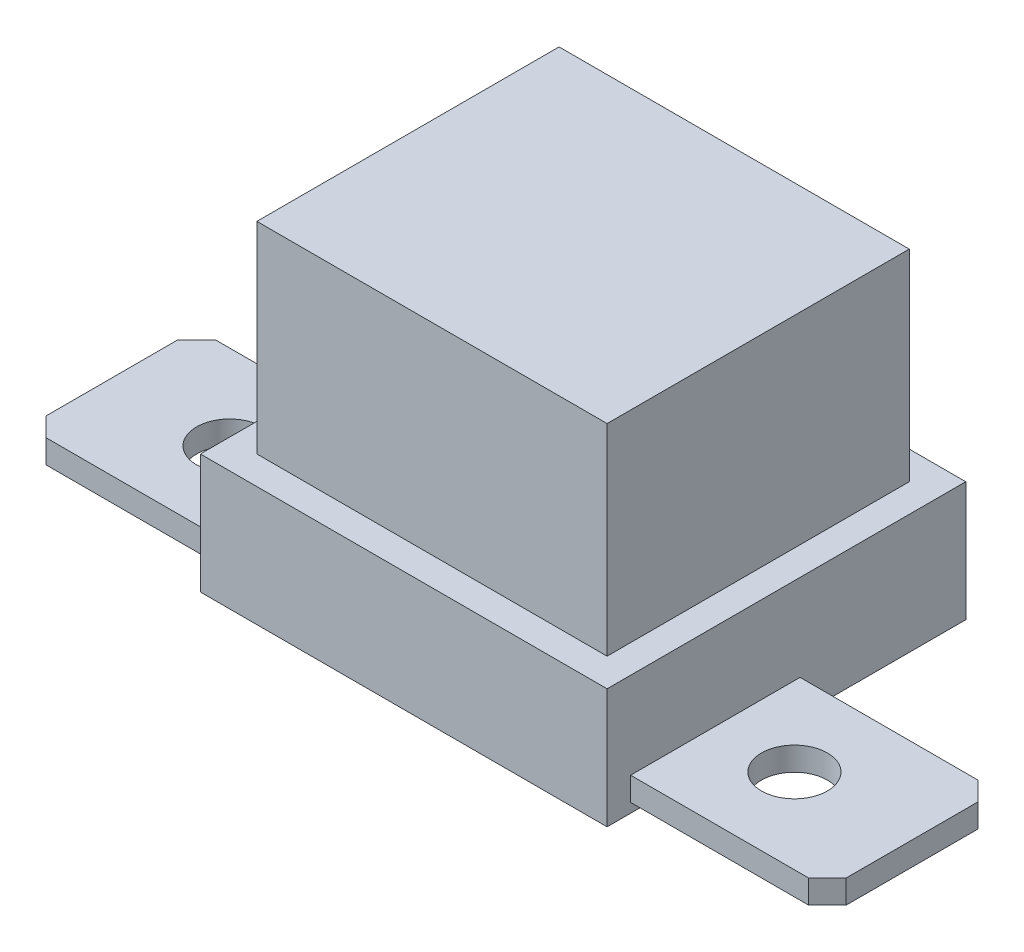
ISO-10303-21;
HEADER;
FILE_DESCRIPTION(('STEP AP214'),'2;1');
FILE_NAME('part.step','',(''),(''),'','','');
FILE_SCHEMA(('AUTOMOTIVE_DESIGN { 1 0 10303 214 1 1 1 1 }'));
ENDSEC;
DATA;
#1=APPLICATION_CONTEXT('core data for automotive mechanical design processes');
#2=APPLICATION_PROTOCOL_DEFINITION('international standard','automotive_design',2000,#1);
#3=PRODUCT_CONTEXT('',#1,'mechanical');
#4=PRODUCT('Part','Part','',(#3));
#5=PRODUCT_RELATED_PRODUCT_CATEGORY('part','',(#4));
#6=PRODUCT_DEFINITION_FORMATION('','',#4);
#7=PRODUCT_DEFINITION_CONTEXT('part definition',#1,'design');
#8=PRODUCT_DEFINITION('design','',#6,#7);
#9=PRODUCT_DEFINITION_SHAPE('','',#8);
#10=(LENGTH_UNIT() NAMED_UNIT(*) SI_UNIT(.MILLI.,.METRE.));
#11=(NAMED_UNIT(*) PLANE_ANGLE_UNIT() SI_UNIT($,.RADIAN.));
#12=(NAMED_UNIT(*) SI_UNIT($,.STERADIAN.) SOLID_ANGLE_UNIT());
#13=UNCERTAINTY_MEASURE_WITH_UNIT(LENGTH_MEASURE(1.E-05),#10,'distance_accuracy_value','');
#14=(GEOMETRIC_REPRESENTATION_CONTEXT(3) GLOBAL_UNCERTAINTY_ASSIGNED_CONTEXT((#13)) GLOBAL_UNIT_ASSIGNED_CONTEXT((#10,
#11,#12)) REPRESENTATION_CONTEXT('',''));
#15=CARTESIAN_POINT('',(0.,0.,0.));
#16=DIRECTION('',(0.,0.,1.));
#17=DIRECTION('',(1.,0.,0.));
#18=AXIS2_PLACEMENT_3D('',#15,#16,#17);
#19=CARTESIAN_POINT('',(21.6,12.7,19.05));
#20=DIRECTION('',(-1.,0.,0.));
#21=DIRECTION('',(0.,0.,1.));
#22=AXIS2_PLACEMENT_3D('',#19,#20,#21);
#23=PLANE('',#22);
#24=DIRECTION('',(0.,0.,-1.));
#25=VECTOR('',#24,1.);
#26=CARTESIAN_POINT('',(21.6,0.,19.05));
#27=LINE('',#26,#25);
#28=CARTESIAN_POINT('',(21.6,0.,19.05));
#29=VERTEX_POINT('',#28);
#30=CARTESIAN_POINT('',(21.6,0.,-19.05));
#31=VERTEX_POINT('',#30);
#32=EDGE_CURVE('E290',#29,#31,#27,.T.);
#33=ORIENTED_EDGE('',*,*,#32,.T.);
#34=DIRECTION('',(0.,-1.,0.));
#35=VECTOR('',#34,1.);
#36=CARTESIAN_POINT('',(21.6,12.7,-19.05));
#37=LINE('',#36,#35);
#38=CARTESIAN_POINT('',(21.6,12.7,-19.05));
#39=VERTEX_POINT('',#38);
#40=EDGE_CURVE('E317',#39,#31,#37,.T.);
#41=ORIENTED_EDGE('',*,*,#40,.F.);
#42=DIRECTION('',(0.,0.,-1.));
#43=VECTOR('',#42,1.);
#44=CARTESIAN_POINT('',(21.6,12.7,19.05));
#45=LINE('',#44,#43);
#46=CARTESIAN_POINT('',(21.6,12.7,19.05));
#47=VERTEX_POINT('',#46);
#48=EDGE_CURVE('E291',#47,#39,#45,.T.);
#49=ORIENTED_EDGE('',*,*,#48,.F.);
#50=DIRECTION('',(0.,-1.,0.));
#51=VECTOR('',#50,1.);
#52=CARTESIAN_POINT('',(21.6,12.7,19.05));
#53=LINE('',#52,#51);
#54=EDGE_CURVE('E301',#47,#29,#53,.T.);
#55=ORIENTED_EDGE('',*,*,#54,.T.);
#56=EDGE_LOOP('',(#33,#41,#49,#55));
#57=FACE_BOUND('',#56,.T.);
#58=DIRECTION('',(0.,-1.,0.));
#59=VECTOR('',#58,1.);
#60=CARTESIAN_POINT('',(21.6,3.5,16.55));
#61=LINE('',#60,#59);
#62=CARTESIAN_POINT('',(21.6,3.5,16.55));
#63=VERTEX_POINT('',#62);
#64=CARTESIAN_POINT('',(21.6,1.,16.55));
#65=VERTEX_POINT('',#64);
#66=EDGE_CURVE('E55',#63,#65,#61,.T.);
#67=ORIENTED_EDGE('',*,*,#66,.F.);
#68=DIRECTION('',(0.,0.,1.));
#69=VECTOR('',#68,1.);
#70=CARTESIAN_POINT('',(21.6,3.5,-1.45));
#71=LINE('',#70,#69);
#72=CARTESIAN_POINT('',(21.6,3.5,-1.45));
#73=VERTEX_POINT('',#72);
#74=EDGE_CURVE('E201',#73,#63,#71,.T.);
#75=ORIENTED_EDGE('',*,*,#74,.F.);
#76=DIRECTION('',(0.,-1.,0.));
#77=VECTOR('',#76,1.);
#78=CARTESIAN_POINT('',(21.6,3.5,-1.45));
#79=LINE('',#78,#77);
#80=CARTESIAN_POINT('',(21.6,0.999999999999999,-1.45));
#81=VERTEX_POINT('',#80);
#82=EDGE_CURVE('E197',#73,#81,#79,.T.);
#83=ORIENTED_EDGE('',*,*,#82,.T.);
#84=DIRECTION('',(0.,0.,1.));
#85=VECTOR('',#84,1.);
#86=CARTESIAN_POINT('',(21.6,1.,-1.45));
#87=LINE('',#86,#85);
#88=EDGE_CURVE('E60',#81,#65,#87,.T.);
#89=ORIENTED_EDGE('',*,*,#88,.T.);
#90=EDGE_LOOP('',(#67,#75,#83,#89));
#91=FACE_BOUND('',#90,.T.);
#92=ADVANCED_FACE('F40',(#57,#91),#23,.F.);
#93=CARTESIAN_POINT('',(-21.6,12.7,19.05));
#94=DIRECTION('',(1.,0.,0.));
#95=DIRECTION('',(0.,0.,-1.));
#96=AXIS2_PLACEMENT_3D('',#93,#94,#95);
#97=PLANE('',#96);
#98=DIRECTION('',(0.,0.,1.));
#99=VECTOR('',#98,1.);
#100=CARTESIAN_POINT('',(-21.6,0.,19.05));
#101=LINE('',#100,#99);
#102=CARTESIAN_POINT('',(-21.6,0.,-19.05));
#103=VERTEX_POINT('',#102);
#104=CARTESIAN_POINT('',(-21.6,0.,19.05));
#105=VERTEX_POINT('',#104);
#106=EDGE_CURVE('E306',#103,#105,#101,.T.);
#107=ORIENTED_EDGE('',*,*,#106,.T.);
#108=DIRECTION('',(0.,-1.,0.));
#109=VECTOR('',#108,1.);
#110=CARTESIAN_POINT('',(-21.6,12.7,19.05));
#111=LINE('',#110,#109);
#112=CARTESIAN_POINT('',(-21.6,12.7,19.05));
#113=VERTEX_POINT('',#112);
#114=EDGE_CURVE('E311',#113,#105,#111,.T.);
#115=ORIENTED_EDGE('',*,*,#114,.F.);
#116=DIRECTION('',(0.,0.,1.));
#117=VECTOR('',#116,1.);
#118=CARTESIAN_POINT('',(-21.6,12.7,19.05));
#119=LINE('',#118,#117);
#120=CARTESIAN_POINT('',(-21.6,12.7,-19.05));
#121=VERTEX_POINT('',#120);
#122=EDGE_CURVE('E297',#121,#113,#119,.T.);
#123=ORIENTED_EDGE('',*,*,#122,.F.);
#124=DIRECTION('',(0.,-1.,0.));
#125=VECTOR('',#124,1.);
#126=CARTESIAN_POINT('',(-21.6,12.7,-19.05));
#127=LINE('',#126,#125);
#128=EDGE_CURVE('E314',#121,#103,#127,.T.);
#129=ORIENTED_EDGE('',*,*,#128,.T.);
#130=EDGE_LOOP('',(#107,#115,#123,#129));
#131=FACE_BOUND('',#130,.T.);
#132=DIRECTION('',(0.,-1.,0.));
#133=VECTOR('',#132,1.);
#134=CARTESIAN_POINT('',(-21.6,3.5,-1.45));
#135=LINE('',#134,#133);
#136=CARTESIAN_POINT('',(-21.6,3.5,-1.45));
#137=VERTEX_POINT('',#136);
#138=CARTESIAN_POINT('',(-21.6,1.,-1.45));
#139=VERTEX_POINT('',#138);
#140=EDGE_CURVE('E275',#137,#139,#135,.T.);
#141=ORIENTED_EDGE('',*,*,#140,.F.);
#142=DIRECTION('',(0.,0.,-1.));
#143=VECTOR('',#142,1.);
#144=CARTESIAN_POINT('',(-21.6,3.5,-1.45));
#145=LINE('',#144,#143);
#146=CARTESIAN_POINT('',(-21.6,3.5,16.55));
#147=VERTEX_POINT('',#146);
#148=EDGE_CURVE('E235',#147,#137,#145,.T.);
#149=ORIENTED_EDGE('',*,*,#148,.F.);
#150=DIRECTION('',(0.,-1.,0.));
#151=VECTOR('',#150,1.);
#152=CARTESIAN_POINT('',(-21.6,3.5,16.55));
#153=LINE('',#152,#151);
#154=CARTESIAN_POINT('',(-21.6,0.999999999999999,16.55));
#155=VERTEX_POINT('',#154);
#156=EDGE_CURVE('E250',#147,#155,#153,.T.);
#157=ORIENTED_EDGE('',*,*,#156,.T.);
#158=DIRECTION('',(0.,0.,-1.));
#159=VECTOR('',#158,1.);
#160=CARTESIAN_POINT('',(-21.6,1.,-1.45));
#161=LINE('',#160,#159);
#162=EDGE_CURVE('E232',#155,#139,#161,.T.);
#163=ORIENTED_EDGE('',*,*,#162,.T.);
#164=EDGE_LOOP('',(#141,#149,#157,#163));
#165=FACE_BOUND('',#164,.T.);
#166=ADVANCED_FACE('F366',(#131,#165),#97,.F.);
#167=CARTESIAN_POINT('',(-18.6,34.1,0.));
#168=DIRECTION('',(-1.,0.,0.));
#169=DIRECTION('',(0.,0.,1.));
#170=AXIS2_PLACEMENT_3D('',#167,#168,#169);
#171=PLANE('',#170);
#172=DIRECTION('',(0.,-1.,0.));
#173=VECTOR('',#172,1.);
#174=CARTESIAN_POINT('',(-18.6,34.1,-16.05));
#175=LINE('',#174,#173);
#176=CARTESIAN_POINT('',(-18.6,34.1,-16.05));
#177=VERTEX_POINT('',#176);
#178=CARTESIAN_POINT('',(-18.6,12.7,-16.05));
#179=VERTEX_POINT('',#178);
#180=EDGE_CURVE('E330',#177,#179,#175,.T.);
#181=ORIENTED_EDGE('',*,*,#180,.T.);
#182=DIRECTION('',(0.,0.,1.));
#183=VECTOR('',#182,1.);
#184=CARTESIAN_POINT('',(-18.6,12.7,16.05));
#185=LINE('',#184,#183);
#186=CARTESIAN_POINT('',(-18.6,12.7,16.05));
#187=VERTEX_POINT('',#186);
#188=EDGE_CURVE('E287',#179,#187,#185,.T.);
#189=ORIENTED_EDGE('',*,*,#188,.T.);
#190=DIRECTION('',(0.,-1.,0.));
#191=VECTOR('',#190,1.);
#192=CARTESIAN_POINT('',(-18.6,34.1,16.05));
#193=LINE('',#192,#191);
#194=CARTESIAN_POINT('',(-18.6,34.1,16.05));
#195=VERTEX_POINT('',#194);
#196=EDGE_CURVE('E11',#195,#187,#193,.T.);
#197=ORIENTED_EDGE('',*,*,#196,.F.);
#198=DIRECTION('',(0.,0.,-1.));
#199=VECTOR('',#198,1.);
#200=CARTESIAN_POINT('',(-18.6,34.1,0.));
#201=LINE('',#200,#199);
#202=EDGE_CURVE('E320',#195,#177,#201,.T.);
#203=ORIENTED_EDGE('',*,*,#202,.T.);
#204=EDGE_LOOP('',(#181,#189,#197,#203));
#205=FACE_BOUND('',#204,.T.);
#206=ADVANCED_FACE('F42',(#205),#171,.T.);
#207=CARTESIAN_POINT('',(0.,34.1,16.05));
#208=DIRECTION('',(0.,0.,-1.));
#209=DIRECTION('',(-1.,0.,0.));
#210=AXIS2_PLACEMENT_3D('',#207,#208,#209);
#211=PLANE('',#210);
#212=DIRECTION('',(1.,0.,0.));
#213=VECTOR('',#212,1.);
#214=CARTESIAN_POINT('',(-18.6,12.7,16.05));
#215=LINE('',#214,#213);
#216=CARTESIAN_POINT('',(18.6,12.7,16.05));
#217=VERTEX_POINT('',#216);
#218=EDGE_CURVE('E278',#187,#217,#215,.T.);
#219=ORIENTED_EDGE('',*,*,#218,.T.);
#220=DIRECTION('',(0.,-1.,0.));
#221=VECTOR('',#220,1.);
#222=CARTESIAN_POINT('',(18.6,34.1,16.05));
#223=LINE('',#222,#221);
#224=CARTESIAN_POINT('',(18.6,34.1,16.05));
#225=VERTEX_POINT('',#224);
#226=EDGE_CURVE('E48',#225,#217,#223,.T.);
#227=ORIENTED_EDGE('',*,*,#226,.F.);
#228=DIRECTION('',(1.,0.,0.));
#229=VECTOR('',#228,1.);
#230=CARTESIAN_POINT('',(0.,34.1,16.05));
#231=LINE('',#230,#229);
#232=EDGE_CURVE('E323',#195,#225,#231,.T.);
#233=ORIENTED_EDGE('',*,*,#232,.F.);
#234=ORIENTED_EDGE('',*,*,#196,.T.);
#235=EDGE_LOOP('',(#219,#227,#233,#234));
#236=FACE_BOUND('',#235,.T.);
#237=ADVANCED_FACE('F343',(#236),#211,.F.);
#238=CARTESIAN_POINT('',(18.6,34.1,0.));
#239=DIRECTION('',(-1.,0.,0.));
#240=DIRECTION('',(0.,0.,1.));
#241=AXIS2_PLACEMENT_3D('',#238,#239,#240);
#242=PLANE('',#241);
#243=DIRECTION('',(0.,0.,-1.));
#244=VECTOR('',#243,1.);
#245=CARTESIAN_POINT('',(18.6,12.7,16.05));
#246=LINE('',#245,#244);
#247=CARTESIAN_POINT('',(18.6,12.7,-16.05));
#248=VERTEX_POINT('',#247);
#249=EDGE_CURVE('E281',#217,#248,#246,.T.);
#250=ORIENTED_EDGE('',*,*,#249,.T.);
#251=DIRECTION('',(0.,-1.,0.));
#252=VECTOR('',#251,1.);
#253=CARTESIAN_POINT('',(18.6,34.1,-16.05));
#254=LINE('',#253,#252);
#255=CARTESIAN_POINT('',(18.6,34.1,-16.05));
#256=VERTEX_POINT('',#255);
#257=EDGE_CURVE('E333',#256,#248,#254,.T.);
#258=ORIENTED_EDGE('',*,*,#257,.F.);
#259=DIRECTION('',(0.,0.,-1.));
#260=VECTOR('',#259,1.);
#261=CARTESIAN_POINT('',(18.6,34.1,0.));
#262=LINE('',#261,#260);
#263=EDGE_CURVE('E325',#225,#256,#262,.T.);
#264=ORIENTED_EDGE('',*,*,#263,.F.);
#265=ORIENTED_EDGE('',*,*,#226,.T.);
#266=EDGE_LOOP('',(#250,#258,#264,#265));
#267=FACE_BOUND('',#266,.T.);
#268=ADVANCED_FACE('F339',(#267),#242,.F.);
#269=CARTESIAN_POINT('',(0.,34.1,-16.05));
#270=DIRECTION('',(0.,0.,-1.));
#271=DIRECTION('',(-1.,0.,0.));
#272=AXIS2_PLACEMENT_3D('',#269,#270,#271);
#273=PLANE('',#272);
#274=ORIENTED_EDGE('',*,*,#257,.T.);
#275=DIRECTION('',(-1.,0.,0.));
#276=VECTOR('',#275,1.);
#277=CARTESIAN_POINT('',(-18.6,12.7,-16.05));
#278=LINE('',#277,#276);
#279=EDGE_CURVE('E284',#248,#179,#278,.T.);
#280=ORIENTED_EDGE('',*,*,#279,.T.);
#281=ORIENTED_EDGE('',*,*,#180,.F.);
#282=DIRECTION('',(1.,0.,0.));
#283=VECTOR('',#282,1.);
#284=CARTESIAN_POINT('',(0.,34.1,-16.05));
#285=LINE('',#284,#283);
#286=EDGE_CURVE('E327',#177,#256,#285,.T.);
#287=ORIENTED_EDGE('',*,*,#286,.T.);
#288=EDGE_LOOP('',(#274,#280,#281,#287));
#289=FACE_BOUND('',#288,.T.);
#290=ADVANCED_FACE('F350',(#289),#273,.T.);
#291=CARTESIAN_POINT('',(0.,34.1,0.));
#292=DIRECTION('',(0.,1.,0.));
#293=DIRECTION('',(0.,0.,1.));
#294=AXIS2_PLACEMENT_3D('',#291,#292,#293);
#295=PLANE('',#294);
#296=ORIENTED_EDGE('',*,*,#202,.F.);
#297=ORIENTED_EDGE('',*,*,#232,.T.);
#298=ORIENTED_EDGE('',*,*,#263,.T.);
#299=ORIENTED_EDGE('',*,*,#286,.F.);
#300=EDGE_LOOP('',(#296,#297,#298,#299));
#301=FACE_BOUND('',#300,.T.);
#302=ADVANCED_FACE('F352',(#301),#295,.T.);
#303=CARTESIAN_POINT('',(0.,12.7,0.));
#304=DIRECTION('',(0.,-1.,0.));
#305=DIRECTION('',(0.,0.,-1.));
#306=AXIS2_PLACEMENT_3D('',#303,#304,#305);
#307=PLANE('',#306);
#308=ORIENTED_EDGE('',*,*,#48,.T.);
#309=DIRECTION('',(-1.,0.,0.));
#310=VECTOR('',#309,1.);
#311=CARTESIAN_POINT('',(-21.6,12.7,-19.05));
#312=LINE('',#311,#310);
#313=EDGE_CURVE('E294',#39,#121,#312,.T.);
#314=ORIENTED_EDGE('',*,*,#313,.T.);
#315=ORIENTED_EDGE('',*,*,#122,.T.);
#316=DIRECTION('',(1.,0.,0.));
#317=VECTOR('',#316,1.);
#318=CARTESIAN_POINT('',(-21.6,12.7,19.05));
#319=LINE('',#318,#317);
#320=EDGE_CURVE('E299',#113,#47,#319,.T.);
#321=ORIENTED_EDGE('',*,*,#320,.T.);
#322=EDGE_LOOP('',(#308,#314,#315,#321));
#323=FACE_BOUND('',#322,.T.);
#324=ORIENTED_EDGE('',*,*,#218,.F.);
#325=ORIENTED_EDGE('',*,*,#188,.F.);
#326=ORIENTED_EDGE('',*,*,#279,.F.);
#327=ORIENTED_EDGE('',*,*,#249,.F.);
#328=EDGE_LOOP('',(#324,#325,#326,#327));
#329=FACE_BOUND('',#328,.T.);
#330=ADVANCED_FACE('F346',(#323,#329),#307,.F.);
#331=CARTESIAN_POINT('',(-21.6,12.7,-19.05));
#332=DIRECTION('',(0.,0.,1.));
#333=DIRECTION('',(1.,0.,0.));
#334=AXIS2_PLACEMENT_3D('',#331,#332,#333);
#335=PLANE('',#334);
#336=DIRECTION('',(-1.,0.,0.));
#337=VECTOR('',#336,1.);
#338=CARTESIAN_POINT('',(-21.6,0.,-19.05));
#339=LINE('',#338,#337);
#340=EDGE_CURVE('E304',#31,#103,#339,.T.);
#341=ORIENTED_EDGE('',*,*,#340,.T.);
#342=ORIENTED_EDGE('',*,*,#128,.F.);
#343=ORIENTED_EDGE('',*,*,#313,.F.);
#344=ORIENTED_EDGE('',*,*,#40,.T.);
#345=EDGE_LOOP('',(#341,#342,#343,#344));
#346=FACE_BOUND('',#345,.T.);
#347=ADVANCED_FACE('F359',(#346),#335,.F.);
#348=CARTESIAN_POINT('',(-21.6,12.7,19.05));
#349=DIRECTION('',(0.,0.,-1.));
#350=DIRECTION('',(-1.,0.,0.));
#351=AXIS2_PLACEMENT_3D('',#348,#349,#350);
#352=PLANE('',#351);
#353=DIRECTION('',(1.,0.,0.));
#354=VECTOR('',#353,1.);
#355=CARTESIAN_POINT('',(-21.6,0.,19.05));
#356=LINE('',#355,#354);
#357=EDGE_CURVE('E295',#105,#29,#356,.T.);
#358=ORIENTED_EDGE('',*,*,#357,.T.);
#359=ORIENTED_EDGE('',*,*,#54,.F.);
#360=ORIENTED_EDGE('',*,*,#320,.F.);
#361=ORIENTED_EDGE('',*,*,#114,.T.);
#362=EDGE_LOOP('',(#358,#359,#360,#361));
#363=FACE_BOUND('',#362,.T.);
#364=ADVANCED_FACE('F375',(#363),#352,.F.);
#365=CARTESIAN_POINT('',(0.,0.,0.));
#366=DIRECTION('',(0.,1.,0.));
#367=DIRECTION('',(0.,0.,1.));
#368=AXIS2_PLACEMENT_3D('',#365,#366,#367);
#369=PLANE('',#368);
#370=ORIENTED_EDGE('',*,*,#32,.F.);
#371=ORIENTED_EDGE('',*,*,#357,.F.);
#372=ORIENTED_EDGE('',*,*,#106,.F.);
#373=ORIENTED_EDGE('',*,*,#340,.F.);
#374=EDGE_LOOP('',(#370,#371,#372,#373));
#375=FACE_BOUND('',#374,.T.);
#376=ADVANCED_FACE('F379',(#375),#369,.F.);
#377=CARTESIAN_POINT('',(0.,3.5,0.));
#378=DIRECTION('',(0.,-1.,0.));
#379=DIRECTION('',(0.,0.,-1.));
#380=AXIS2_PLACEMENT_3D('',#377,#378,#379);
#381=PLANE('',#380);
#382=ORIENTED_EDGE('',*,*,#148,.T.);
#383=DIRECTION('',(-1.,0.,0.));
#384=VECTOR('',#383,1.);
#385=CARTESIAN_POINT('',(-21.6,3.5,-1.45));
#386=LINE('',#385,#384);
#387=CARTESIAN_POINT('',(-40.5,3.5,-1.45));
#388=VERTEX_POINT('',#387);
#389=EDGE_CURVE('E238',#137,#388,#386,.T.);
#390=ORIENTED_EDGE('',*,*,#389,.T.);
#391=DIRECTION('',(-0.707106781186548,0.,0.707106781186547));
#392=VECTOR('',#391,1.);
#393=CARTESIAN_POINT('',(-40.5,3.5,-1.45));
#394=LINE('',#393,#392);
#395=CARTESIAN_POINT('',(-42.5,3.5,0.550000000000003));
#396=VERTEX_POINT('',#395);
#397=EDGE_CURVE('E241',#388,#396,#394,.T.);
#398=ORIENTED_EDGE('',*,*,#397,.T.);
#399=DIRECTION('',(0.,0.,1.));
#400=VECTOR('',#399,1.);
#401=CARTESIAN_POINT('',(-42.5,3.5,0.550000000000003));
#402=LINE('',#401,#400);
#403=CARTESIAN_POINT('',(-42.5,3.5,14.55));
#404=VERTEX_POINT('',#403);
#405=EDGE_CURVE('E243',#396,#404,#402,.T.);
#406=ORIENTED_EDGE('',*,*,#405,.T.);
#407=DIRECTION('',(0.707106781186548,0.,0.707106781186547));
#408=VECTOR('',#407,1.);
#409=CARTESIAN_POINT('',(-40.5,3.5,16.55));
#410=LINE('',#409,#408);
#411=CARTESIAN_POINT('',(-40.5,3.5,16.55));
#412=VERTEX_POINT('',#411);
#413=EDGE_CURVE('E245',#404,#412,#410,.T.);
#414=ORIENTED_EDGE('',*,*,#413,.T.);
#415=DIRECTION('',(1.,0.,0.));
#416=VECTOR('',#415,1.);
#417=CARTESIAN_POINT('',(-21.6,3.5,16.55));
#418=LINE('',#417,#416);
#419=EDGE_CURVE('E247',#412,#147,#418,.T.);
#420=ORIENTED_EDGE('',*,*,#419,.T.);
#421=EDGE_LOOP('',(#382,#390,#398,#406,#414,#420));
#422=FACE_BOUND('',#421,.T.);
#423=CARTESIAN_POINT('',(-30.,3.5,7.55));
#424=DIRECTION('',(0.,1.,0.));
#425=DIRECTION('',(0.,0.,1.));
#426=AXIS2_PLACEMENT_3D('',#423,#424,#425);
#427=CIRCLE('',#426,3.5);
#428=CARTESIAN_POINT('',(-30.,3.5,11.05));
#429=VERTEX_POINT('',#428);
#430=EDGE_CURVE('E229',#429,#429,#427,.T.);
#431=ORIENTED_EDGE('',*,*,#430,.F.);
#432=EDGE_LOOP('',(#431));
#433=FACE_BOUND('',#432,.T.);
#434=ADVANCED_FACE('F406',(#422,#433),#381,.F.);
#435=CARTESIAN_POINT('',(0.,1.,0.));
#436=DIRECTION('',(0.,-1.,0.));
#437=DIRECTION('',(0.,0.,-1.));
#438=AXIS2_PLACEMENT_3D('',#435,#436,#437);
#439=PLANE('',#438);
#440=ORIENTED_EDGE('',*,*,#162,.F.);
#441=DIRECTION('',(1.,0.,0.));
#442=VECTOR('',#441,1.);
#443=CARTESIAN_POINT('',(-21.6,1.,16.55));
#444=LINE('',#443,#442);
#445=CARTESIAN_POINT('',(-40.5,1.,16.55));
#446=VERTEX_POINT('',#445);
#447=EDGE_CURVE('E239',#446,#155,#444,.T.);
#448=ORIENTED_EDGE('',*,*,#447,.F.);
#449=DIRECTION('',(0.707106781186548,0.,0.707106781186547));
#450=VECTOR('',#449,1.);
#451=CARTESIAN_POINT('',(-40.5,1.,16.55));
#452=LINE('',#451,#450);
#453=CARTESIAN_POINT('',(-42.5,1.,14.55));
#454=VERTEX_POINT('',#453);
#455=EDGE_CURVE('E258',#454,#446,#452,.T.);
#456=ORIENTED_EDGE('',*,*,#455,.F.);
#457=DIRECTION('',(0.,0.,1.));
#458=VECTOR('',#457,1.);
#459=CARTESIAN_POINT('',(-42.5,1.,0.550000000000003));
#460=LINE('',#459,#458);
#461=CARTESIAN_POINT('',(-42.5,1.,0.550000000000003));
#462=VERTEX_POINT('',#461);
#463=EDGE_CURVE('E256',#462,#454,#460,.T.);
#464=ORIENTED_EDGE('',*,*,#463,.F.);
#465=DIRECTION('',(-0.707106781186548,0.,0.707106781186547));
#466=VECTOR('',#465,1.);
#467=CARTESIAN_POINT('',(-40.5,1.,-1.45));
#468=LINE('',#467,#466);
#469=CARTESIAN_POINT('',(-40.5,1.,-1.45));
#470=VERTEX_POINT('',#469);
#471=EDGE_CURVE('E254',#470,#462,#468,.T.);
#472=ORIENTED_EDGE('',*,*,#471,.F.);
#473=DIRECTION('',(-1.,0.,0.));
#474=VECTOR('',#473,1.);
#475=CARTESIAN_POINT('',(-21.6,1.,-1.45));
#476=LINE('',#475,#474);
#477=EDGE_CURVE('E252',#139,#470,#476,.T.);
#478=ORIENTED_EDGE('',*,*,#477,.F.);
#479=EDGE_LOOP('',(#440,#448,#456,#464,#472,#478));
#480=FACE_BOUND('',#479,.T.);
#481=CARTESIAN_POINT('',(-30.,1.,7.55));
#482=DIRECTION('',(0.,1.,0.));
#483=DIRECTION('',(0.,0.,1.));
#484=AXIS2_PLACEMENT_3D('',#481,#482,#483);
#485=CIRCLE('',#484,3.5);
#486=CARTESIAN_POINT('',(-30.,1.,11.05));
#487=VERTEX_POINT('',#486);
#488=EDGE_CURVE('E226',#487,#487,#485,.T.);
#489=ORIENTED_EDGE('',*,*,#488,.T.);
#490=EDGE_LOOP('',(#489));
#491=FACE_BOUND('',#490,.T.);
#492=ADVANCED_FACE('F386',(#480,#491),#439,.T.);
#493=CARTESIAN_POINT('',(-21.6,3.5,-1.45));
#494=DIRECTION('',(0.,0.,1.));
#495=DIRECTION('',(1.,0.,0.));
#496=AXIS2_PLACEMENT_3D('',#493,#494,#495);
#497=PLANE('',#496);
#498=ORIENTED_EDGE('',*,*,#477,.T.);
#499=DIRECTION('',(0.,-1.,0.));
#500=VECTOR('',#499,1.);
#501=CARTESIAN_POINT('',(-40.5,3.5,-1.45));
#502=LINE('',#501,#500);
#503=EDGE_CURVE('E272',#388,#470,#502,.T.);
#504=ORIENTED_EDGE('',*,*,#503,.F.);
#505=ORIENTED_EDGE('',*,*,#389,.F.);
#506=ORIENTED_EDGE('',*,*,#140,.T.);
#507=EDGE_LOOP('',(#498,#504,#505,#506));
#508=FACE_BOUND('',#507,.T.);
#509=ADVANCED_FACE('F382',(#508),#497,.F.);
#510=CARTESIAN_POINT('',(-40.5,3.5,-1.45));
#511=DIRECTION('',(0.707106781186547,0.,0.707106781186548));
#512=DIRECTION('',(0.707106781186548,0.,-0.707106781186547));
#513=AXIS2_PLACEMENT_3D('',#510,#511,#512);
#514=PLANE('',#513);
#515=ORIENTED_EDGE('',*,*,#471,.T.);
#516=DIRECTION('',(0.,-1.,0.));
#517=VECTOR('',#516,1.);
#518=CARTESIAN_POINT('',(-42.5,3.5,0.550000000000003));
#519=LINE('',#518,#517);
#520=EDGE_CURVE('E269',#396,#462,#519,.T.);
#521=ORIENTED_EDGE('',*,*,#520,.F.);
#522=ORIENTED_EDGE('',*,*,#397,.F.);
#523=ORIENTED_EDGE('',*,*,#503,.T.);
#524=EDGE_LOOP('',(#515,#521,#522,#523));
#525=FACE_BOUND('',#524,.T.);
#526=ADVANCED_FACE('F385',(#525),#514,.F.);
#527=CARTESIAN_POINT('',(-42.5,3.5,0.550000000000003));
#528=DIRECTION('',(1.,0.,0.));
#529=DIRECTION('',(0.,0.,-1.));
#530=AXIS2_PLACEMENT_3D('',#527,#528,#529);
#531=PLANE('',#530);
#532=ORIENTED_EDGE('',*,*,#463,.T.);
#533=DIRECTION('',(0.,-1.,0.));
#534=VECTOR('',#533,1.);
#535=CARTESIAN_POINT('',(-42.5,3.5,14.55));
#536=LINE('',#535,#534);
#537=EDGE_CURVE('E266',#404,#454,#536,.T.);
#538=ORIENTED_EDGE('',*,*,#537,.F.);
#539=ORIENTED_EDGE('',*,*,#405,.F.);
#540=ORIENTED_EDGE('',*,*,#520,.T.);
#541=EDGE_LOOP('',(#532,#538,#539,#540));
#542=FACE_BOUND('',#541,.T.);
#543=ADVANCED_FACE('F390',(#542),#531,.F.);
#544=CARTESIAN_POINT('',(-40.5,3.5,16.55));
#545=DIRECTION('',(0.707106781186547,0.,-0.707106781186548));
#546=DIRECTION('',(-0.707106781186548,0.,-0.707106781186547));
#547=AXIS2_PLACEMENT_3D('',#544,#545,#546);
#548=PLANE('',#547);
#549=ORIENTED_EDGE('',*,*,#455,.T.);
#550=DIRECTION('',(0.,-1.,0.));
#551=VECTOR('',#550,1.);
#552=CARTESIAN_POINT('',(-40.5,3.5,16.55));
#553=LINE('',#552,#551);
#554=EDGE_CURVE('E263',#412,#446,#553,.T.);
#555=ORIENTED_EDGE('',*,*,#554,.F.);
#556=ORIENTED_EDGE('',*,*,#413,.F.);
#557=ORIENTED_EDGE('',*,*,#537,.T.);
#558=EDGE_LOOP('',(#549,#555,#556,#557));
#559=FACE_BOUND('',#558,.T.);
#560=ADVANCED_FACE('F394',(#559),#548,.F.);
#561=CARTESIAN_POINT('',(-21.6,3.5,16.55));
#562=DIRECTION('',(0.,0.,-1.));
#563=DIRECTION('',(-1.,0.,0.));
#564=AXIS2_PLACEMENT_3D('',#561,#562,#563);
#565=PLANE('',#564);
#566=ORIENTED_EDGE('',*,*,#447,.T.);
#567=ORIENTED_EDGE('',*,*,#156,.F.);
#568=ORIENTED_EDGE('',*,*,#419,.F.);
#569=ORIENTED_EDGE('',*,*,#554,.T.);
#570=EDGE_LOOP('',(#566,#567,#568,#569));
#571=FACE_BOUND('',#570,.T.);
#572=ADVANCED_FACE('F398',(#571),#565,.F.);
#573=CARTESIAN_POINT('',(-30.,3.5,7.55));
#574=DIRECTION('',(0.,-1.,0.));
#575=DIRECTION('',(0.,0.,-1.));
#576=AXIS2_PLACEMENT_3D('',#573,#574,#575);
#577=CYLINDRICAL_SURFACE('',#576,3.5);
#578=ORIENTED_EDGE('',*,*,#430,.T.);
#579=EDGE_LOOP('',(#578));
#580=FACE_BOUND('',#579,.T.);
#581=ORIENTED_EDGE('',*,*,#488,.F.);
#582=EDGE_LOOP('',(#581));
#583=FACE_BOUND('',#582,.T.);
#584=ADVANCED_FACE('F402',(#580,#583),#577,.F.);
#585=CARTESIAN_POINT('',(0.,3.5,0.));
#586=DIRECTION('',(0.,1.,0.));
#587=DIRECTION('',(0.,0.,1.));
#588=AXIS2_PLACEMENT_3D('',#585,#586,#587);
#589=PLANE('',#588);
#590=ORIENTED_EDGE('',*,*,#74,.T.);
#591=DIRECTION('',(1.,0.,0.));
#592=VECTOR('',#591,1.);
#593=CARTESIAN_POINT('',(21.6,3.5,16.55));
#594=LINE('',#593,#592);
#595=CARTESIAN_POINT('',(40.5,3.5,16.55));
#596=VERTEX_POINT('',#595);
#597=EDGE_CURVE('E204',#63,#596,#594,.T.);
#598=ORIENTED_EDGE('',*,*,#597,.T.);
#599=DIRECTION('',(0.707106781186548,0.,-0.707106781186547));
#600=VECTOR('',#599,1.);
#601=CARTESIAN_POINT('',(40.5,3.5,16.55));
#602=LINE('',#601,#600);
#603=CARTESIAN_POINT('',(42.5,3.5,14.55));
#604=VERTEX_POINT('',#603);
#605=EDGE_CURVE('E220',#596,#604,#602,.T.);
#606=ORIENTED_EDGE('',*,*,#605,.T.);
#607=DIRECTION('',(0.,0.,-1.));
#608=VECTOR('',#607,1.);
#609=CARTESIAN_POINT('',(42.5,3.5,0.550000000000003));
#610=LINE('',#609,#608);
#611=CARTESIAN_POINT('',(42.5,3.5,0.550000000000003));
#612=VERTEX_POINT('',#611);
#613=EDGE_CURVE('E218',#604,#612,#610,.T.);
#614=ORIENTED_EDGE('',*,*,#613,.T.);
#615=DIRECTION('',(-0.707106781186548,0.,-0.707106781186547));
#616=VECTOR('',#615,1.);
#617=CARTESIAN_POINT('',(40.5,3.5,-1.45));
#618=LINE('',#617,#616);
#619=CARTESIAN_POINT('',(40.5,3.5,-1.45));
#620=VERTEX_POINT('',#619);
#621=EDGE_CURVE('E216',#612,#620,#618,.T.);
#622=ORIENTED_EDGE('',*,*,#621,.T.);
#623=DIRECTION('',(-1.,0.,0.));
#624=VECTOR('',#623,1.);
#625=CARTESIAN_POINT('',(21.6,3.5,-1.45));
#626=LINE('',#625,#624);
#627=EDGE_CURVE('E196',#620,#73,#626,.T.);
#628=ORIENTED_EDGE('',*,*,#627,.T.);
#629=EDGE_LOOP('',(#590,#598,#606,#614,#622,#628));
#630=FACE_BOUND('',#629,.T.);
#631=CARTESIAN_POINT('',(30.,3.5,7.55));
#632=DIRECTION('',(0.,1.,0.));
#633=DIRECTION('',(0.,0.,-1.));
#634=AXIS2_PLACEMENT_3D('',#631,#632,#633);
#635=CIRCLE('',#634,3.5);
#636=CARTESIAN_POINT('',(30.,3.5,4.05));
#637=VERTEX_POINT('',#636);
#638=EDGE_CURVE('E214',#637,#637,#635,.T.);
#639=ORIENTED_EDGE('',*,*,#638,.F.);
#640=EDGE_LOOP('',(#639));
#641=FACE_BOUND('',#640,.T.);
#642=ADVANCED_FACE('F413',(#630,#641),#589,.T.);
#643=CARTESIAN_POINT('',(0.,1.,0.));
#644=DIRECTION('',(0.,1.,0.));
#645=DIRECTION('',(0.,0.,1.));
#646=AXIS2_PLACEMENT_3D('',#643,#644,#645);
#647=PLANE('',#646);
#648=ORIENTED_EDGE('',*,*,#88,.F.);
#649=DIRECTION('',(-1.,0.,0.));
#650=VECTOR('',#649,1.);
#651=CARTESIAN_POINT('',(21.6,1.,-1.45));
#652=LINE('',#651,#650);
#653=CARTESIAN_POINT('',(40.5,1.,-1.45));
#654=VERTEX_POINT('',#653);
#655=EDGE_CURVE('E189',#654,#81,#652,.T.);
#656=ORIENTED_EDGE('',*,*,#655,.F.);
#657=DIRECTION('',(-0.707106781186548,0.,-0.707106781186547));
#658=VECTOR('',#657,1.);
#659=CARTESIAN_POINT('',(40.5,1.,-1.45));
#660=LINE('',#659,#658);
#661=CARTESIAN_POINT('',(42.5,1.,0.550000000000003));
#662=VERTEX_POINT('',#661);
#663=EDGE_CURVE('E177',#662,#654,#660,.T.);
#664=ORIENTED_EDGE('',*,*,#663,.F.);
#665=DIRECTION('',(0.,0.,-1.));
#666=VECTOR('',#665,1.);
#667=CARTESIAN_POINT('',(42.5,1.,0.550000000000003));
#668=LINE('',#667,#666);
#669=CARTESIAN_POINT('',(42.5,1.,14.55));
#670=VERTEX_POINT('',#669);
#671=EDGE_CURVE('E188',#670,#662,#668,.T.);
#672=ORIENTED_EDGE('',*,*,#671,.F.);
#673=DIRECTION('',(0.707106781186548,0.,-0.707106781186547));
#674=VECTOR('',#673,1.);
#675=CARTESIAN_POINT('',(40.5,1.,16.55));
#676=LINE('',#675,#674);
#677=CARTESIAN_POINT('',(40.5,1.,16.55));
#678=VERTEX_POINT('',#677);
#679=EDGE_CURVE('E209',#678,#670,#676,.T.);
#680=ORIENTED_EDGE('',*,*,#679,.F.);
#681=DIRECTION('',(1.,0.,0.));
#682=VECTOR('',#681,1.);
#683=CARTESIAN_POINT('',(21.6,1.,16.55));
#684=LINE('',#683,#682);
#685=EDGE_CURVE('E211',#65,#678,#684,.T.);
#686=ORIENTED_EDGE('',*,*,#685,.F.);
#687=EDGE_LOOP('',(#648,#656,#664,#672,#680,#686));
#688=FACE_BOUND('',#687,.T.);
#689=CARTESIAN_POINT('',(30.,1.,7.55));
#690=DIRECTION('',(0.,1.,0.));
#691=DIRECTION('',(0.,0.,-1.));
#692=AXIS2_PLACEMENT_3D('',#689,#690,#691);
#693=CIRCLE('',#692,3.5);
#694=CARTESIAN_POINT('',(30.,1.,4.05));
#695=VERTEX_POINT('',#694);
#696=EDGE_CURVE('E223',#695,#695,#693,.T.);
#697=ORIENTED_EDGE('',*,*,#696,.T.);
#698=EDGE_LOOP('',(#697));
#699=FACE_BOUND('',#698,.T.);
#700=ADVANCED_FACE('F199',(#688,#699),#647,.F.);
#701=CARTESIAN_POINT('',(21.6,3.5,16.55));
#702=DIRECTION('',(0.,0.,-1.));
#703=DIRECTION('',(-1.,0.,0.));
#704=AXIS2_PLACEMENT_3D('',#701,#702,#703);
#705=PLANE('',#704);
#706=ORIENTED_EDGE('',*,*,#685,.T.);
#707=DIRECTION('',(0.,-1.,0.));
#708=VECTOR('',#707,1.);
#709=CARTESIAN_POINT('',(40.5,3.5,16.55));
#710=LINE('',#709,#708);
#711=EDGE_CURVE('E443',#596,#678,#710,.T.);
#712=ORIENTED_EDGE('',*,*,#711,.F.);
#713=ORIENTED_EDGE('',*,*,#597,.F.);
#714=ORIENTED_EDGE('',*,*,#66,.T.);
#715=EDGE_LOOP('',(#706,#712,#713,#714));
#716=FACE_BOUND('',#715,.T.);
#717=ADVANCED_FACE('F424',(#716),#705,.F.);
#718=CARTESIAN_POINT('',(40.5,3.5,16.55));
#719=DIRECTION('',(-0.707106781186547,0.,-0.707106781186548));
#720=DIRECTION('',(-0.707106781186548,0.,0.707106781186547));
#721=AXIS2_PLACEMENT_3D('',#718,#719,#720);
#722=PLANE('',#721);
#723=ORIENTED_EDGE('',*,*,#679,.T.);
#724=DIRECTION('',(0.,-1.,0.));
#725=VECTOR('',#724,1.);
#726=CARTESIAN_POINT('',(42.5,3.5,14.55));
#727=LINE('',#726,#725);
#728=EDGE_CURVE('E448',#604,#670,#727,.T.);
#729=ORIENTED_EDGE('',*,*,#728,.F.);
#730=ORIENTED_EDGE('',*,*,#605,.F.);
#731=ORIENTED_EDGE('',*,*,#711,.T.);
#732=EDGE_LOOP('',(#723,#729,#730,#731));
#733=FACE_BOUND('',#732,.T.);
#734=ADVANCED_FACE('F432',(#733),#722,.F.);
#735=CARTESIAN_POINT('',(42.5,3.5,0.550000000000003));
#736=DIRECTION('',(-1.,0.,0.));
#737=DIRECTION('',(0.,0.,1.));
#738=AXIS2_PLACEMENT_3D('',#735,#736,#737);
#739=PLANE('',#738);
#740=ORIENTED_EDGE('',*,*,#671,.T.);
#741=DIRECTION('',(0.,-1.,0.));
#742=VECTOR('',#741,1.);
#743=CARTESIAN_POINT('',(42.5,3.5,0.550000000000003));
#744=LINE('',#743,#742);
#745=EDGE_CURVE('E184',#612,#662,#744,.T.);
#746=ORIENTED_EDGE('',*,*,#745,.F.);
#747=ORIENTED_EDGE('',*,*,#613,.F.);
#748=ORIENTED_EDGE('',*,*,#728,.T.);
#749=EDGE_LOOP('',(#740,#746,#747,#748));
#750=FACE_BOUND('',#749,.T.);
#751=ADVANCED_FACE('F429',(#750),#739,.F.);
#752=CARTESIAN_POINT('',(40.5,3.5,-1.45));
#753=DIRECTION('',(-0.707106781186547,0.,0.707106781186548));
#754=DIRECTION('',(0.707106781186548,0.,0.707106781186547));
#755=AXIS2_PLACEMENT_3D('',#752,#753,#754);
#756=PLANE('',#755);
#757=ORIENTED_EDGE('',*,*,#663,.T.);
#758=DIRECTION('',(0.,-1.,0.));
#759=VECTOR('',#758,1.);
#760=CARTESIAN_POINT('',(40.5,3.5,-1.45));
#761=LINE('',#760,#759);
#762=EDGE_CURVE('E181',#620,#654,#761,.T.);
#763=ORIENTED_EDGE('',*,*,#762,.F.);
#764=ORIENTED_EDGE('',*,*,#621,.F.);
#765=ORIENTED_EDGE('',*,*,#745,.T.);
#766=EDGE_LOOP('',(#757,#763,#764,#765));
#767=FACE_BOUND('',#766,.T.);
#768=ADVANCED_FACE('F179',(#767),#756,.F.);
#769=CARTESIAN_POINT('',(21.6,3.5,-1.45));
#770=DIRECTION('',(0.,0.,1.));
#771=DIRECTION('',(1.,0.,0.));
#772=AXIS2_PLACEMENT_3D('',#769,#770,#771);
#773=PLANE('',#772);
#774=ORIENTED_EDGE('',*,*,#655,.T.);
#775=ORIENTED_EDGE('',*,*,#82,.F.);
#776=ORIENTED_EDGE('',*,*,#627,.F.);
#777=ORIENTED_EDGE('',*,*,#762,.T.);
#778=EDGE_LOOP('',(#774,#775,#776,#777));
#779=FACE_BOUND('',#778,.T.);
#780=ADVANCED_FACE('F193',(#779),#773,.F.);
#781=CARTESIAN_POINT('',(30.,3.5,7.55));
#782=DIRECTION('',(0.,-1.,0.));
#783=DIRECTION('',(0.,0.,-1.));
#784=AXIS2_PLACEMENT_3D('',#781,#782,#783);
#785=CYLINDRICAL_SURFACE('',#784,3.5);
#786=ORIENTED_EDGE('',*,*,#638,.T.);
#787=EDGE_LOOP('',(#786));
#788=FACE_BOUND('',#787,.T.);
#789=ORIENTED_EDGE('',*,*,#696,.F.);
#790=EDGE_LOOP('',(#789));
#791=FACE_BOUND('',#790,.T.);
#792=ADVANCED_FACE('F415',(#788,#791),#785,.F.);
#793=CLOSED_SHELL('',(#92,#166,#206,#237,#268,#290,#302,#330,#347,#364,#376,#434,#492,#509,#526,
#543,#560,#572,#584,#642,#700,#717,#734,#751,#768,#780,#792));
#794=MANIFOLD_SOLID_BREP('B2',#793);
#795=ADVANCED_BREP_SHAPE_REPRESENTATION('',(#18,#794),#14);
#796=SHAPE_DEFINITION_REPRESENTATION(#9,#795);
ENDSEC;
END-ISO-10303-21;
